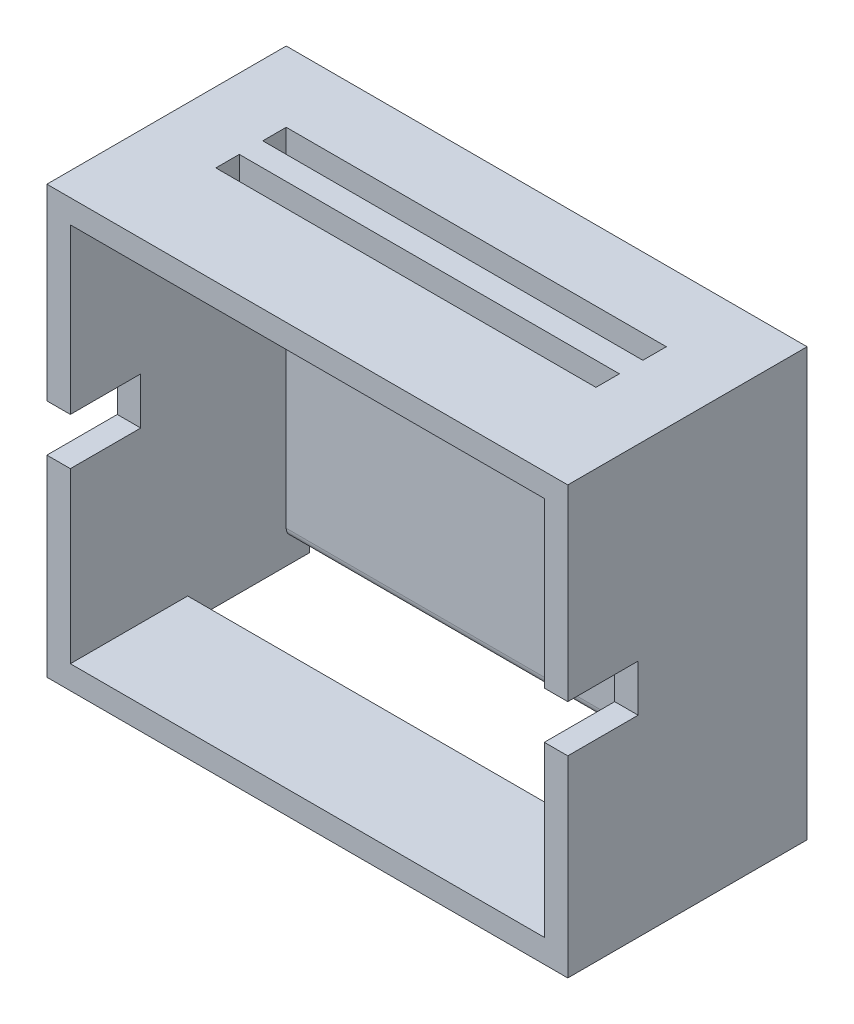
ISO-10303-21;
HEADER;
FILE_DESCRIPTION(('STEP AP214'),'2;1');
FILE_NAME('part.step','',(''),(''),'','','');
FILE_SCHEMA(('AUTOMOTIVE_DESIGN { 1 0 10303 214 1 1 1 1 }'));
ENDSEC;
DATA;
#1=APPLICATION_CONTEXT('core data for automotive mechanical design processes');
#2=APPLICATION_PROTOCOL_DEFINITION('international standard','automotive_design',2000,#1);
#3=PRODUCT_CONTEXT('',#1,'mechanical');
#4=PRODUCT('Part','Part','',(#3));
#5=PRODUCT_RELATED_PRODUCT_CATEGORY('part','',(#4));
#6=PRODUCT_DEFINITION_FORMATION('','',#4);
#7=PRODUCT_DEFINITION_CONTEXT('part definition',#1,'design');
#8=PRODUCT_DEFINITION('design','',#6,#7);
#9=PRODUCT_DEFINITION_SHAPE('','',#8);
#10=(LENGTH_UNIT() NAMED_UNIT(*) SI_UNIT(.MILLI.,.METRE.));
#11=(NAMED_UNIT(*) PLANE_ANGLE_UNIT() SI_UNIT($,.RADIAN.));
#12=(NAMED_UNIT(*) SI_UNIT($,.STERADIAN.) SOLID_ANGLE_UNIT());
#13=UNCERTAINTY_MEASURE_WITH_UNIT(LENGTH_MEASURE(1.E-05),#10,'distance_accuracy_value','');
#14=(GEOMETRIC_REPRESENTATION_CONTEXT(3) GLOBAL_UNCERTAINTY_ASSIGNED_CONTEXT((#13)) GLOBAL_UNIT_ASSIGNED_CONTEXT((#10,
#11,#12)) REPRESENTATION_CONTEXT('',''));
#15=CARTESIAN_POINT('',(0.,0.,0.));
#16=DIRECTION('',(0.,0.,1.));
#17=DIRECTION('',(1.,0.,0.));
#18=AXIS2_PLACEMENT_3D('',#15,#16,#17);
#19=CARTESIAN_POINT('',(0.,0.,46.));
#20=DIRECTION('',(0.,0.,1.));
#21=DIRECTION('',(1.,0.,0.));
#22=AXIS2_PLACEMENT_3D('',#19,#20,#21);
#23=PLANE('',#22);
#24=DIRECTION('',(-1.,0.,0.));
#25=VECTOR('',#24,1.);
#26=CARTESIAN_POINT('',(-37.1088887201052,11.7555404321783,46.));
#27=LINE('',#26,#25);
#28=CARTESIAN_POINT('',(-32.1088887201052,11.7555404321783,46.));
#29=VERTEX_POINT('',#28);
#30=CARTESIAN_POINT('',(-37.1088887201052,11.7555404321783,46.));
#31=VERTEX_POINT('',#30);
#32=EDGE_CURVE('E329',#29,#31,#27,.T.);
#33=ORIENTED_EDGE('',*,*,#32,.F.);
#34=DIRECTION('',(0.,-1.,0.));
#35=VECTOR('',#34,1.);
#36=CARTESIAN_POINT('',(-32.1088887201052,46.7555404321783,46.));
#37=LINE('',#36,#35);
#38=CARTESIAN_POINT('',(-32.1088887201052,46.7555404321783,46.));
#39=VERTEX_POINT('',#38);
#40=EDGE_CURVE('E448',#39,#29,#37,.T.);
#41=ORIENTED_EDGE('',*,*,#40,.F.);
#42=DIRECTION('',(-1.,0.,0.));
#43=VECTOR('',#42,1.);
#44=CARTESIAN_POINT('',(-32.1088887201052,46.7555404321783,46.));
#45=LINE('',#44,#43);
#46=CARTESIAN_POINT('',(68.8911112798948,46.7555404321783,46.));
#47=VERTEX_POINT('',#46);
#48=EDGE_CURVE('E461',#47,#39,#45,.T.);
#49=ORIENTED_EDGE('',*,*,#48,.F.);
#50=DIRECTION('',(0.,1.,0.));
#51=VECTOR('',#50,1.);
#52=CARTESIAN_POINT('',(68.8911112798948,46.7555404321783,46.));
#53=LINE('',#52,#51);
#54=CARTESIAN_POINT('',(68.8911112798948,11.7555404321783,46.));
#55=VERTEX_POINT('',#54);
#56=EDGE_CURVE('E456',#55,#47,#53,.T.);
#57=ORIENTED_EDGE('',*,*,#56,.F.);
#58=DIRECTION('',(-1.,0.,0.));
#59=VECTOR('',#58,1.);
#60=CARTESIAN_POINT('',(68.8911112798948,11.7555404321783,46.));
#61=LINE('',#60,#59);
#62=CARTESIAN_POINT('',(73.8911112798948,11.7555404321783,46.));
#63=VERTEX_POINT('',#62);
#64=EDGE_CURVE('E365',#63,#55,#61,.T.);
#65=ORIENTED_EDGE('',*,*,#64,.F.);
#66=DIRECTION('',(0.,1.,0.));
#67=VECTOR('',#66,1.);
#68=CARTESIAN_POINT('',(73.8911112798948,51.7555404321783,46.));
#69=LINE('',#68,#67);
#70=CARTESIAN_POINT('',(73.8911112798948,51.7555404321783,46.));
#71=VERTEX_POINT('',#70);
#72=EDGE_CURVE('E497',#63,#71,#69,.T.);
#73=ORIENTED_EDGE('',*,*,#72,.T.);
#74=DIRECTION('',(-1.,0.,0.));
#75=VECTOR('',#74,1.);
#76=CARTESIAN_POINT('',(-37.1088887201052,51.7555404321783,46.));
#77=LINE('',#76,#75);
#78=CARTESIAN_POINT('',(-37.1088887201052,51.7555404321783,46.));
#79=VERTEX_POINT('',#78);
#80=EDGE_CURVE('E502',#71,#79,#77,.T.);
#81=ORIENTED_EDGE('',*,*,#80,.T.);
#82=DIRECTION('',(0.,-1.,0.));
#83=VECTOR('',#82,1.);
#84=CARTESIAN_POINT('',(-37.1088887201052,51.7555404321783,46.));
#85=LINE('',#84,#83);
#86=EDGE_CURVE('E490',#79,#31,#85,.T.);
#87=ORIENTED_EDGE('',*,*,#86,.T.);
#88=EDGE_LOOP('',(#33,#41,#49,#57,#65,#73,#81,#87));
#89=FACE_BOUND('',#88,.T.);
#90=ADVANCED_FACE('F39',(#89),#23,.T.);
#91=DIRECTION('',(1.,0.,0.));
#92=VECTOR('',#91,1.);
#93=CARTESIAN_POINT('',(-37.1088887201052,1.75554043217829,46.));
#94=LINE('',#93,#92);
#95=CARTESIAN_POINT('',(-37.1088887201052,1.75554043217829,46.));
#96=VERTEX_POINT('',#95);
#97=CARTESIAN_POINT('',(-32.1088887201052,1.75554043217829,46.));
#98=VERTEX_POINT('',#97);
#99=EDGE_CURVE('E340',#96,#98,#94,.T.);
#100=ORIENTED_EDGE('',*,*,#99,.F.);
#101=CARTESIAN_POINT('',(-37.1088887201052,-39.2444595678217,46.));
#102=VERTEX_POINT('',#101);
#103=EDGE_CURVE('E489',#96,#102,#85,.T.);
#104=ORIENTED_EDGE('',*,*,#103,.T.);
#105=DIRECTION('',(1.,0.,0.));
#106=VECTOR('',#105,1.);
#107=CARTESIAN_POINT('',(-37.1088887201052,-39.2444595678217,46.));
#108=LINE('',#107,#106);
#109=CARTESIAN_POINT('',(73.8911112798948,-39.2444595678217,46.));
#110=VERTEX_POINT('',#109);
#111=EDGE_CURVE('E494',#102,#110,#108,.T.);
#112=ORIENTED_EDGE('',*,*,#111,.T.);
#113=CARTESIAN_POINT('',(73.8911112798948,1.75554043217829,46.));
#114=VERTEX_POINT('',#113);
#115=EDGE_CURVE('E498',#110,#114,#69,.T.);
#116=ORIENTED_EDGE('',*,*,#115,.T.);
#117=DIRECTION('',(1.,0.,0.));
#118=VECTOR('',#117,1.);
#119=CARTESIAN_POINT('',(68.8911112798948,1.75554043217829,46.));
#120=LINE('',#119,#118);
#121=CARTESIAN_POINT('',(68.8911112798948,1.75554043217829,46.));
#122=VERTEX_POINT('',#121);
#123=EDGE_CURVE('E277',#122,#114,#120,.T.);
#124=ORIENTED_EDGE('',*,*,#123,.F.);
#125=CARTESIAN_POINT('',(68.8911112798948,-34.2444595678217,46.));
#126=VERTEX_POINT('',#125);
#127=EDGE_CURVE('E457',#126,#122,#53,.T.);
#128=ORIENTED_EDGE('',*,*,#127,.F.);
#129=DIRECTION('',(1.,0.,0.));
#130=VECTOR('',#129,1.);
#131=CARTESIAN_POINT('',(-32.1088887201052,-34.2444595678217,46.));
#132=LINE('',#131,#130);
#133=CARTESIAN_POINT('',(-32.1088887201052,-34.2444595678217,46.));
#134=VERTEX_POINT('',#133);
#135=EDGE_CURVE('E452',#134,#126,#132,.T.);
#136=ORIENTED_EDGE('',*,*,#135,.F.);
#137=EDGE_CURVE('E453',#98,#134,#37,.T.);
#138=ORIENTED_EDGE('',*,*,#137,.F.);
#139=EDGE_LOOP('',(#100,#104,#112,#116,#124,#128,#136,#138));
#140=FACE_BOUND('',#139,.T.);
#141=ADVANCED_FACE('F572',(#140),#23,.T.);
#142=CARTESIAN_POINT('',(-37.1088887201052,51.7555404321783,46.));
#143=DIRECTION('',(1.,0.,0.));
#144=DIRECTION('',(0.,1.,0.));
#145=AXIS2_PLACEMENT_3D('',#142,#143,#144);
#146=PLANE('',#145);
#147=DIRECTION('',(0.,-1.,0.));
#148=VECTOR('',#147,1.);
#149=CARTESIAN_POINT('',(-37.1088887201052,11.7555404321783,31.));
#150=LINE('',#149,#148);
#151=CARTESIAN_POINT('',(-37.1088887201052,11.7555404321783,31.));
#152=VERTEX_POINT('',#151);
#153=CARTESIAN_POINT('',(-37.1088887201052,1.75554043217829,31.));
#154=VERTEX_POINT('',#153);
#155=EDGE_CURVE('E324',#152,#154,#150,.T.);
#156=ORIENTED_EDGE('',*,*,#155,.F.);
#157=DIRECTION('',(0.,0.,1.));
#158=VECTOR('',#157,1.);
#159=CARTESIAN_POINT('',(-37.1088887201052,11.7555404321783,31.));
#160=LINE('',#159,#158);
#161=EDGE_CURVE('E346',#152,#31,#160,.T.);
#162=ORIENTED_EDGE('',*,*,#161,.T.);
#163=ORIENTED_EDGE('',*,*,#86,.F.);
#164=DIRECTION('',(0.,0.,-1.));
#165=VECTOR('',#164,1.);
#166=CARTESIAN_POINT('',(-37.1088887201052,51.7555404321783,46.));
#167=LINE('',#166,#165);
#168=CARTESIAN_POINT('',(-37.1088887201052,51.7555404321783,-5.));
#169=VERTEX_POINT('',#168);
#170=EDGE_CURVE('E505',#79,#169,#167,.T.);
#171=ORIENTED_EDGE('',*,*,#170,.T.);
#172=DIRECTION('',(0.,1.,0.));
#173=VECTOR('',#172,1.);
#174=CARTESIAN_POINT('',(-37.1088887201052,-39.2444595678217,-5.));
#175=LINE('',#174,#173);
#176=CARTESIAN_POINT('',(-37.1088887201052,-39.2444595678217,-5.));
#177=VERTEX_POINT('',#176);
#178=EDGE_CURVE('E421',#177,#169,#175,.T.);
#179=ORIENTED_EDGE('',*,*,#178,.F.);
#180=DIRECTION('',(0.,0.,-1.));
#181=VECTOR('',#180,1.);
#182=CARTESIAN_POINT('',(-37.1088887201052,-39.2444595678217,46.));
#183=LINE('',#182,#181);
#184=EDGE_CURVE('E514',#102,#177,#183,.T.);
#185=ORIENTED_EDGE('',*,*,#184,.F.);
#186=ORIENTED_EDGE('',*,*,#103,.F.);
#187=DIRECTION('',(0.,0.,1.));
#188=VECTOR('',#187,1.);
#189=CARTESIAN_POINT('',(-37.1088887201052,1.75554043217829,31.));
#190=LINE('',#189,#188);
#191=EDGE_CURVE('E339',#154,#96,#190,.T.);
#192=ORIENTED_EDGE('',*,*,#191,.F.);
#193=EDGE_LOOP('',(#156,#162,#163,#171,#179,#185,#186,#192));
#194=FACE_BOUND('',#193,.T.);
#195=ADVANCED_FACE('F559',(#194),#146,.F.);
#196=CARTESIAN_POINT('',(-37.1088887201052,-39.2444595678217,46.));
#197=DIRECTION('',(0.,1.,0.));
#198=DIRECTION('',(0.,0.,1.));
#199=AXIS2_PLACEMENT_3D('',#196,#197,#198);
#200=PLANE('',#199);
#201=DIRECTION('',(-1.,0.,0.));
#202=VECTOR('',#201,1.);
#203=CARTESIAN_POINT('',(-37.1088887201052,-39.2444595678217,-5.));
#204=LINE('',#203,#202);
#205=CARTESIAN_POINT('',(-32.1088887201052,-39.2444595678217,-5.));
#206=VERTEX_POINT('',#205);
#207=EDGE_CURVE('E442',#206,#177,#204,.T.);
#208=ORIENTED_EDGE('',*,*,#207,.F.);
#209=DIRECTION('',(0.,0.,-1.));
#210=VECTOR('',#209,1.);
#211=CARTESIAN_POINT('',(-32.1088887201052,-39.2444595678217,21.));
#212=LINE('',#211,#210);
#213=CARTESIAN_POINT('',(-32.1088887201052,-39.2444595678217,21.));
#214=VERTEX_POINT('',#213);
#215=EDGE_CURVE('E350',#214,#206,#212,.T.);
#216=ORIENTED_EDGE('',*,*,#215,.F.);
#217=DIRECTION('',(-1.,0.,0.));
#218=VECTOR('',#217,1.);
#219=CARTESIAN_POINT('',(-32.1088887201052,-39.2444595678217,21.));
#220=LINE('',#219,#218);
#221=CARTESIAN_POINT('',(68.8911112798948,-39.2444595678217,21.));
#222=VERTEX_POINT('',#221);
#223=EDGE_CURVE('E396',#222,#214,#220,.T.);
#224=ORIENTED_EDGE('',*,*,#223,.F.);
#225=DIRECTION('',(0.,0.,1.));
#226=VECTOR('',#225,1.);
#227=CARTESIAN_POINT('',(68.8911112798948,-39.2444595678217,21.));
#228=LINE('',#227,#226);
#229=CARTESIAN_POINT('',(68.8911112798948,-39.2444595678217,-5.));
#230=VERTEX_POINT('',#229);
#231=EDGE_CURVE('E411',#230,#222,#228,.T.);
#232=ORIENTED_EDGE('',*,*,#231,.F.);
#233=CARTESIAN_POINT('',(73.8911112798948,-39.2444595678217,-5.));
#234=VERTEX_POINT('',#233);
#235=EDGE_CURVE('E443',#234,#230,#204,.T.);
#236=ORIENTED_EDGE('',*,*,#235,.F.);
#237=DIRECTION('',(0.,0.,-1.));
#238=VECTOR('',#237,1.);
#239=CARTESIAN_POINT('',(73.8911112798948,-39.2444595678217,46.));
#240=LINE('',#239,#238);
#241=EDGE_CURVE('E511',#110,#234,#240,.T.);
#242=ORIENTED_EDGE('',*,*,#241,.F.);
#243=ORIENTED_EDGE('',*,*,#111,.F.);
#244=ORIENTED_EDGE('',*,*,#184,.T.);
#245=EDGE_LOOP('',(#208,#216,#224,#232,#236,#242,#243,#244));
#246=FACE_BOUND('',#245,.T.);
#247=ADVANCED_FACE('F584',(#246),#200,.F.);
#248=CARTESIAN_POINT('',(73.8911112798948,51.7555404321783,46.));
#249=DIRECTION('',(-1.,0.,0.));
#250=DIRECTION('',(0.,0.,1.));
#251=AXIS2_PLACEMENT_3D('',#248,#249,#250);
#252=PLANE('',#251);
#253=ORIENTED_EDGE('',*,*,#72,.F.);
#254=DIRECTION('',(0.,0.,1.));
#255=VECTOR('',#254,1.);
#256=CARTESIAN_POINT('',(73.8911112798948,11.7555404321783,31.));
#257=LINE('',#256,#255);
#258=CARTESIAN_POINT('',(73.8911112798948,11.7555404321783,31.));
#259=VERTEX_POINT('',#258);
#260=EDGE_CURVE('E383',#259,#63,#257,.T.);
#261=ORIENTED_EDGE('',*,*,#260,.F.);
#262=DIRECTION('',(0.,1.,0.));
#263=VECTOR('',#262,1.);
#264=CARTESIAN_POINT('',(73.8911112798948,11.7555404321783,31.));
#265=LINE('',#264,#263);
#266=CARTESIAN_POINT('',(73.8911112798948,1.75554043217829,31.));
#267=VERTEX_POINT('',#266);
#268=EDGE_CURVE('E369',#267,#259,#265,.T.);
#269=ORIENTED_EDGE('',*,*,#268,.F.);
#270=DIRECTION('',(0.,0.,1.));
#271=VECTOR('',#270,1.);
#272=CARTESIAN_POINT('',(73.8911112798948,1.75554043217829,31.));
#273=LINE('',#272,#271);
#274=EDGE_CURVE('E386',#267,#114,#273,.T.);
#275=ORIENTED_EDGE('',*,*,#274,.T.);
#276=ORIENTED_EDGE('',*,*,#115,.F.);
#277=ORIENTED_EDGE('',*,*,#241,.T.);
#278=DIRECTION('',(0.,-1.,0.));
#279=VECTOR('',#278,1.);
#280=CARTESIAN_POINT('',(73.8911112798948,-39.2444595678217,-5.));
#281=LINE('',#280,#279);
#282=CARTESIAN_POINT('',(73.8911112798948,51.7555404321783,-5.));
#283=VERTEX_POINT('',#282);
#284=EDGE_CURVE('E438',#283,#234,#281,.T.);
#285=ORIENTED_EDGE('',*,*,#284,.F.);
#286=DIRECTION('',(0.,0.,-1.));
#287=VECTOR('',#286,1.);
#288=CARTESIAN_POINT('',(73.8911112798948,51.7555404321783,46.));
#289=LINE('',#288,#287);
#290=EDGE_CURVE('E508',#71,#283,#289,.T.);
#291=ORIENTED_EDGE('',*,*,#290,.F.);
#292=EDGE_LOOP('',(#253,#261,#269,#275,#276,#277,#285,#291));
#293=FACE_BOUND('',#292,.T.);
#294=ADVANCED_FACE('F596',(#293),#252,.F.);
#295=CARTESIAN_POINT('',(-37.1088887201052,51.7555404321783,46.));
#296=DIRECTION('',(0.,-1.,0.));
#297=DIRECTION('',(0.,0.,-1.));
#298=AXIS2_PLACEMENT_3D('',#295,#296,#297);
#299=PLANE('',#298);
#300=DIRECTION('',(-1.,0.,0.));
#301=VECTOR('',#300,1.);
#302=CARTESIAN_POINT('',(58.8911112798948,51.7555404321783,20.));
#303=LINE('',#302,#301);
#304=CARTESIAN_POINT('',(58.8911112798948,51.7555404321783,20.));
#305=VERTEX_POINT('',#304);
#306=CARTESIAN_POINT('',(-22.1088887201052,51.7555404321783,20.));
#307=VERTEX_POINT('',#306);
#308=EDGE_CURVE('E267',#305,#307,#303,.T.);
#309=ORIENTED_EDGE('',*,*,#308,.F.);
#310=DIRECTION('',(0.,0.,-1.));
#311=VECTOR('',#310,1.);
#312=CARTESIAN_POINT('',(58.8911112798948,51.7555404321783,25.));
#313=LINE('',#312,#311);
#314=CARTESIAN_POINT('',(58.8911112798948,51.7555404321783,25.));
#315=VERTEX_POINT('',#314);
#316=EDGE_CURVE('E55',#315,#305,#313,.T.);
#317=ORIENTED_EDGE('',*,*,#316,.F.);
#318=DIRECTION('',(1.,0.,0.));
#319=VECTOR('',#318,1.);
#320=CARTESIAN_POINT('',(58.8911112798948,51.7555404321783,25.));
#321=LINE('',#320,#319);
#322=CARTESIAN_POINT('',(-22.1088887201052,51.7555404321783,25.));
#323=VERTEX_POINT('',#322);
#324=EDGE_CURVE('E254',#323,#315,#321,.T.);
#325=ORIENTED_EDGE('',*,*,#324,.F.);
#326=DIRECTION('',(0.,0.,1.));
#327=VECTOR('',#326,1.);
#328=CARTESIAN_POINT('',(-22.1088887201052,51.7555404321783,25.));
#329=LINE('',#328,#327);
#330=EDGE_CURVE('E258',#307,#323,#329,.T.);
#331=ORIENTED_EDGE('',*,*,#330,.F.);
#332=EDGE_LOOP('',(#309,#317,#325,#331));
#333=FACE_BOUND('',#332,.T.);
#334=DIRECTION('',(-1.,0.,0.));
#335=VECTOR('',#334,1.);
#336=CARTESIAN_POINT('',(58.8911112798948,51.7555404321783,10.));
#337=LINE('',#336,#335);
#338=CARTESIAN_POINT('',(58.8911112798948,51.7555404321783,10.));
#339=VERTEX_POINT('',#338);
#340=CARTESIAN_POINT('',(-22.1088887201052,51.7555404321783,10.));
#341=VERTEX_POINT('',#340);
#342=EDGE_CURVE('E303',#339,#341,#337,.T.);
#343=ORIENTED_EDGE('',*,*,#342,.F.);
#344=DIRECTION('',(0.,0.,-1.));
#345=VECTOR('',#344,1.);
#346=CARTESIAN_POINT('',(58.8911112798948,51.7555404321783,15.));
#347=LINE('',#346,#345);
#348=CARTESIAN_POINT('',(58.8911112798948,51.7555404321783,15.));
#349=VERTEX_POINT('',#348);
#350=EDGE_CURVE('E63',#349,#339,#347,.T.);
#351=ORIENTED_EDGE('',*,*,#350,.F.);
#352=DIRECTION('',(1.,0.,0.));
#353=VECTOR('',#352,1.);
#354=CARTESIAN_POINT('',(58.8911112798948,51.7555404321783,15.));
#355=LINE('',#354,#353);
#356=CARTESIAN_POINT('',(-22.1088887201052,51.7555404321783,15.));
#357=VERTEX_POINT('',#356);
#358=EDGE_CURVE('E288',#357,#349,#355,.T.);
#359=ORIENTED_EDGE('',*,*,#358,.F.);
#360=DIRECTION('',(0.,0.,1.));
#361=VECTOR('',#360,1.);
#362=CARTESIAN_POINT('',(-22.1088887201052,51.7555404321783,15.));
#363=LINE('',#362,#361);
#364=EDGE_CURVE('E307',#341,#357,#363,.T.);
#365=ORIENTED_EDGE('',*,*,#364,.F.);
#366=EDGE_LOOP('',(#343,#351,#359,#365));
#367=FACE_BOUND('',#366,.T.);
#368=ORIENTED_EDGE('',*,*,#290,.T.);
#369=DIRECTION('',(1.,0.,0.));
#370=VECTOR('',#369,1.);
#371=CARTESIAN_POINT('',(-37.1088887201052,51.7555404321783,-5.));
#372=LINE('',#371,#370);
#373=EDGE_CURVE('E434',#169,#283,#372,.T.);
#374=ORIENTED_EDGE('',*,*,#373,.F.);
#375=ORIENTED_EDGE('',*,*,#170,.F.);
#376=ORIENTED_EDGE('',*,*,#80,.F.);
#377=EDGE_LOOP('',(#368,#374,#375,#376));
#378=FACE_BOUND('',#377,.T.);
#379=ADVANCED_FACE('F590',(#333,#367,#378),#299,.F.);
#380=CARTESIAN_POINT('',(-32.1088887201052,46.7555404321783,46.));
#381=DIRECTION('',(1.,0.,0.));
#382=DIRECTION('',(0.,1.,0.));
#383=AXIS2_PLACEMENT_3D('',#380,#381,#382);
#384=PLANE('',#383);
#385=DIRECTION('',(0.,0.,1.));
#386=VECTOR('',#385,1.);
#387=CARTESIAN_POINT('',(-32.1088887201052,11.7555404321783,31.));
#388=LINE('',#387,#386);
#389=CARTESIAN_POINT('',(-32.1088887201052,11.7555404321783,31.));
#390=VERTEX_POINT('',#389);
#391=EDGE_CURVE('E351',#390,#29,#388,.T.);
#392=ORIENTED_EDGE('',*,*,#391,.F.);
#393=DIRECTION('',(0.,1.,0.));
#394=VECTOR('',#393,1.);
#395=CARTESIAN_POINT('',(-32.1088887201052,11.7555404321783,31.));
#396=LINE('',#395,#394);
#397=CARTESIAN_POINT('',(-32.1088887201052,1.75554043217829,31.));
#398=VERTEX_POINT('',#397);
#399=EDGE_CURVE('E332',#398,#390,#396,.T.);
#400=ORIENTED_EDGE('',*,*,#399,.F.);
#401=DIRECTION('',(0.,0.,1.));
#402=VECTOR('',#401,1.);
#403=CARTESIAN_POINT('',(-32.1088887201052,1.75554043217829,31.));
#404=LINE('',#403,#402);
#405=EDGE_CURVE('E354',#398,#98,#404,.T.);
#406=ORIENTED_EDGE('',*,*,#405,.T.);
#407=ORIENTED_EDGE('',*,*,#137,.T.);
#408=DIRECTION('',(0.,0.,-1.));
#409=VECTOR('',#408,1.);
#410=CARTESIAN_POINT('',(-32.1088887201052,-34.2444595678217,46.));
#411=LINE('',#410,#409);
#412=CARTESIAN_POINT('',(-32.1088887201052,-34.2444595678217,21.));
#413=VERTEX_POINT('',#412);
#414=EDGE_CURVE('E485',#134,#413,#411,.T.);
#415=ORIENTED_EDGE('',*,*,#414,.T.);
#416=DIRECTION('',(0.,-1.,0.));
#417=VECTOR('',#416,1.);
#418=CARTESIAN_POINT('',(-32.1088887201052,-34.2444595678217,21.));
#419=LINE('',#418,#417);
#420=EDGE_CURVE('E418',#413,#214,#419,.T.);
#421=ORIENTED_EDGE('',*,*,#420,.T.);
#422=ORIENTED_EDGE('',*,*,#215,.T.);
#423=DIRECTION('',(0.,-1.,0.));
#424=VECTOR('',#423,1.);
#425=CARTESIAN_POINT('',(-32.1088887201052,-34.2444595678217,-5.));
#426=LINE('',#425,#424);
#427=CARTESIAN_POINT('',(-32.1088887201052,-34.2444595678217,-5.));
#428=VERTEX_POINT('',#427);
#429=EDGE_CURVE('E408',#428,#206,#426,.T.);
#430=ORIENTED_EDGE('',*,*,#429,.F.);
#431=DIRECTION('',(0.,0.,-1.));
#432=VECTOR('',#431,1.);
#433=CARTESIAN_POINT('',(-32.1088887201052,-34.2444595678217,21.));
#434=LINE('',#433,#432);
#435=CARTESIAN_POINT('',(-32.1088887201052,-34.2444595678217,-1.99999999999999));
#436=VERTEX_POINT('',#435);
#437=EDGE_CURVE('E392',#436,#428,#434,.T.);
#438=ORIENTED_EDGE('',*,*,#437,.F.);
#439=CARTESIAN_POINT('',(-32.1088887201052,-32.2444595678217,-2.));
#440=DIRECTION('',(1.,0.,0.));
#441=DIRECTION('',(0.,1.,0.));
#442=AXIS2_PLACEMENT_3D('',#439,#440,#441);
#443=CIRCLE('',#442,2.);
#444=CARTESIAN_POINT('',(-32.1088887201052,-32.2444595678217,0.));
#445=VERTEX_POINT('',#444);
#446=EDGE_CURVE('E11',#436,#445,#443,.F.);
#447=ORIENTED_EDGE('',*,*,#446,.T.);
#448=DIRECTION('',(0.,-1.,0.));
#449=VECTOR('',#448,1.);
#450=CARTESIAN_POINT('',(-32.1088887201052,46.7555404321783,0.));
#451=LINE('',#450,#449);
#452=CARTESIAN_POINT('',(-32.1088887201052,46.7555404321783,0.));
#453=VERTEX_POINT('',#452);
#454=EDGE_CURVE('E447',#453,#445,#451,.T.);
#455=ORIENTED_EDGE('',*,*,#454,.F.);
#456=DIRECTION('',(0.,0.,-1.));
#457=VECTOR('',#456,1.);
#458=CARTESIAN_POINT('',(-32.1088887201052,46.7555404321783,46.));
#459=LINE('',#458,#457);
#460=EDGE_CURVE('E464',#39,#453,#459,.T.);
#461=ORIENTED_EDGE('',*,*,#460,.F.);
#462=ORIENTED_EDGE('',*,*,#40,.T.);
#463=EDGE_LOOP('',(#392,#400,#406,#407,#415,#421,#422,#430,#438,#447,#455,#461,#462));
#464=FACE_BOUND('',#463,.T.);
#465=ADVANCED_FACE('F540',(#464),#384,.T.);
#466=CARTESIAN_POINT('',(-32.1088887201052,-34.2444595678217,46.));
#467=DIRECTION('',(0.,1.,0.));
#468=DIRECTION('',(0.,0.,1.));
#469=AXIS2_PLACEMENT_3D('',#466,#467,#468);
#470=PLANE('',#469);
#471=DIRECTION('',(-1.,0.,0.));
#472=VECTOR('',#471,1.);
#473=CARTESIAN_POINT('',(-32.1088887201052,-34.2444595678217,21.));
#474=LINE('',#473,#472);
#475=CARTESIAN_POINT('',(68.8911112798948,-34.2444595678217,21.));
#476=VERTEX_POINT('',#475);
#477=EDGE_CURVE('E404',#476,#413,#474,.T.);
#478=ORIENTED_EDGE('',*,*,#477,.T.);
#479=ORIENTED_EDGE('',*,*,#414,.F.);
#480=ORIENTED_EDGE('',*,*,#135,.T.);
#481=DIRECTION('',(0.,0.,-1.));
#482=VECTOR('',#481,1.);
#483=CARTESIAN_POINT('',(68.8911112798948,-34.2444595678217,46.));
#484=LINE('',#483,#482);
#485=EDGE_CURVE('E481',#126,#476,#484,.T.);
#486=ORIENTED_EDGE('',*,*,#485,.T.);
#487=EDGE_LOOP('',(#478,#479,#480,#486));
#488=FACE_BOUND('',#487,.T.);
#489=ADVANCED_FACE('F605',(#488),#470,.T.);
#490=CARTESIAN_POINT('',(68.8911112798948,46.7555404321783,46.));
#491=DIRECTION('',(-1.,0.,0.));
#492=DIRECTION('',(0.,-1.,0.));
#493=AXIS2_PLACEMENT_3D('',#490,#491,#492);
#494=PLANE('',#493);
#495=DIRECTION('',(0.,0.,1.));
#496=VECTOR('',#495,1.);
#497=CARTESIAN_POINT('',(68.8911112798948,11.7555404321783,31.));
#498=LINE('',#497,#496);
#499=CARTESIAN_POINT('',(68.8911112798948,11.7555404321783,31.));
#500=VERTEX_POINT('',#499);
#501=EDGE_CURVE('E343',#500,#55,#498,.T.);
#502=ORIENTED_EDGE('',*,*,#501,.T.);
#503=ORIENTED_EDGE('',*,*,#56,.T.);
#504=DIRECTION('',(0.,0.,-1.));
#505=VECTOR('',#504,1.);
#506=CARTESIAN_POINT('',(68.8911112798948,46.7555404321783,46.));
#507=LINE('',#506,#505);
#508=CARTESIAN_POINT('',(68.8911112798948,46.7555404321783,0.));
#509=VERTEX_POINT('',#508);
#510=EDGE_CURVE('E477',#47,#509,#507,.T.);
#511=ORIENTED_EDGE('',*,*,#510,.T.);
#512=DIRECTION('',(0.,1.,0.));
#513=VECTOR('',#512,1.);
#514=CARTESIAN_POINT('',(68.8911112798948,46.7555404321783,0.));
#515=LINE('',#514,#513);
#516=CARTESIAN_POINT('',(68.8911112798948,-32.2444595678217,0.));
#517=VERTEX_POINT('',#516);
#518=EDGE_CURVE('E468',#517,#509,#515,.T.);
#519=ORIENTED_EDGE('',*,*,#518,.F.);
#520=CARTESIAN_POINT('',(68.8911112798948,-32.2444595678217,-2.));
#521=DIRECTION('',(-1.,0.,0.));
#522=DIRECTION('',(0.,-1.,0.));
#523=AXIS2_PLACEMENT_3D('',#520,#521,#522);
#524=CIRCLE('',#523,2.);
#525=CARTESIAN_POINT('',(68.8911112798948,-34.2444595678217,-1.99999999999999));
#526=VERTEX_POINT('',#525);
#527=EDGE_CURVE('E48',#517,#526,#524,.F.);
#528=ORIENTED_EDGE('',*,*,#527,.T.);
#529=DIRECTION('',(0.,0.,1.));
#530=VECTOR('',#529,1.);
#531=CARTESIAN_POINT('',(68.8911112798948,-34.2444595678217,21.));
#532=LINE('',#531,#530);
#533=CARTESIAN_POINT('',(68.8911112798948,-34.2444595678217,-5.));
#534=VERTEX_POINT('',#533);
#535=EDGE_CURVE('E400',#534,#526,#532,.T.);
#536=ORIENTED_EDGE('',*,*,#535,.F.);
#537=DIRECTION('',(0.,-1.,0.));
#538=VECTOR('',#537,1.);
#539=CARTESIAN_POINT('',(68.8911112798948,-34.2444595678217,-5.));
#540=LINE('',#539,#538);
#541=EDGE_CURVE('E425',#534,#230,#540,.T.);
#542=ORIENTED_EDGE('',*,*,#541,.T.);
#543=ORIENTED_EDGE('',*,*,#231,.T.);
#544=DIRECTION('',(0.,-1.,0.));
#545=VECTOR('',#544,1.);
#546=CARTESIAN_POINT('',(68.8911112798948,-34.2444595678217,21.));
#547=LINE('',#546,#545);
#548=EDGE_CURVE('E422',#476,#222,#547,.T.);
#549=ORIENTED_EDGE('',*,*,#548,.F.);
#550=ORIENTED_EDGE('',*,*,#485,.F.);
#551=ORIENTED_EDGE('',*,*,#127,.T.);
#552=DIRECTION('',(0.,0.,1.));
#553=VECTOR('',#552,1.);
#554=CARTESIAN_POINT('',(68.8911112798948,1.75554043217829,31.));
#555=LINE('',#554,#553);
#556=CARTESIAN_POINT('',(68.8911112798948,1.75554043217829,31.));
#557=VERTEX_POINT('',#556);
#558=EDGE_CURVE('E375',#557,#122,#555,.T.);
#559=ORIENTED_EDGE('',*,*,#558,.F.);
#560=DIRECTION('',(0.,-1.,0.));
#561=VECTOR('',#560,1.);
#562=CARTESIAN_POINT('',(68.8911112798948,11.7555404321783,31.));
#563=LINE('',#562,#561);
#564=EDGE_CURVE('E360',#500,#557,#563,.T.);
#565=ORIENTED_EDGE('',*,*,#564,.F.);
#566=EDGE_LOOP('',(#502,#503,#511,#519,#528,#536,#542,#543,#549,#550,#551,#559,#565));
#567=FACE_BOUND('',#566,.T.);
#568=ADVANCED_FACE('F527',(#567),#494,.T.);
#569=CARTESIAN_POINT('',(-32.1088887201052,46.7555404321783,46.));
#570=DIRECTION('',(0.,-1.,0.));
#571=DIRECTION('',(0.,0.,-1.));
#572=AXIS2_PLACEMENT_3D('',#569,#570,#571);
#573=PLANE('',#572);
#574=DIRECTION('',(0.,0.,-1.));
#575=VECTOR('',#574,1.);
#576=CARTESIAN_POINT('',(58.8911112798948,46.7555404321783,25.));
#577=LINE('',#576,#575);
#578=CARTESIAN_POINT('',(58.8911112798948,46.7555404321783,25.));
#579=VERTEX_POINT('',#578);
#580=CARTESIAN_POINT('',(58.8911112798948,46.7555404321783,20.));
#581=VERTEX_POINT('',#580);
#582=EDGE_CURVE('E232',#579,#581,#577,.T.);
#583=ORIENTED_EDGE('',*,*,#582,.T.);
#584=DIRECTION('',(-1.,0.,0.));
#585=VECTOR('',#584,1.);
#586=CARTESIAN_POINT('',(58.8911112798948,46.7555404321783,20.));
#587=LINE('',#586,#585);
#588=CARTESIAN_POINT('',(-22.1088887201052,46.7555404321783,20.));
#589=VERTEX_POINT('',#588);
#590=EDGE_CURVE('E243',#581,#589,#587,.T.);
#591=ORIENTED_EDGE('',*,*,#590,.T.);
#592=DIRECTION('',(0.,0.,1.));
#593=VECTOR('',#592,1.);
#594=CARTESIAN_POINT('',(-22.1088887201052,46.7555404321783,25.));
#595=LINE('',#594,#593);
#596=CARTESIAN_POINT('',(-22.1088887201052,46.7555404321783,25.));
#597=VERTEX_POINT('',#596);
#598=EDGE_CURVE('E248',#589,#597,#595,.T.);
#599=ORIENTED_EDGE('',*,*,#598,.T.);
#600=DIRECTION('',(1.,0.,0.));
#601=VECTOR('',#600,1.);
#602=CARTESIAN_POINT('',(58.8911112798948,46.7555404321783,25.));
#603=LINE('',#602,#601);
#604=EDGE_CURVE('E239',#597,#579,#603,.T.);
#605=ORIENTED_EDGE('',*,*,#604,.T.);
#606=EDGE_LOOP('',(#583,#591,#599,#605));
#607=FACE_BOUND('',#606,.T.);
#608=DIRECTION('',(0.,0.,-1.));
#609=VECTOR('',#608,1.);
#610=CARTESIAN_POINT('',(58.8911112798948,46.7555404321783,15.));
#611=LINE('',#610,#609);
#612=CARTESIAN_POINT('',(58.8911112798948,46.7555404321783,15.));
#613=VERTEX_POINT('',#612);
#614=CARTESIAN_POINT('',(58.8911112798948,46.7555404321783,10.));
#615=VERTEX_POINT('',#614);
#616=EDGE_CURVE('E283',#613,#615,#611,.T.);
#617=ORIENTED_EDGE('',*,*,#616,.T.);
#618=DIRECTION('',(-1.,0.,0.));
#619=VECTOR('',#618,1.);
#620=CARTESIAN_POINT('',(58.8911112798948,46.7555404321783,10.));
#621=LINE('',#620,#619);
#622=CARTESIAN_POINT('',(-22.1088887201052,46.7555404321783,10.));
#623=VERTEX_POINT('',#622);
#624=EDGE_CURVE('E287',#615,#623,#621,.T.);
#625=ORIENTED_EDGE('',*,*,#624,.T.);
#626=DIRECTION('',(0.,0.,1.));
#627=VECTOR('',#626,1.);
#628=CARTESIAN_POINT('',(-22.1088887201052,46.7555404321783,15.));
#629=LINE('',#628,#627);
#630=CARTESIAN_POINT('',(-22.1088887201052,46.7555404321783,15.));
#631=VERTEX_POINT('',#630);
#632=EDGE_CURVE('E292',#623,#631,#629,.T.);
#633=ORIENTED_EDGE('',*,*,#632,.T.);
#634=DIRECTION('',(1.,0.,0.));
#635=VECTOR('',#634,1.);
#636=CARTESIAN_POINT('',(58.8911112798948,46.7555404321783,15.));
#637=LINE('',#636,#635);
#638=EDGE_CURVE('E296',#631,#613,#637,.T.);
#639=ORIENTED_EDGE('',*,*,#638,.T.);
#640=EDGE_LOOP('',(#617,#625,#633,#639));
#641=FACE_BOUND('',#640,.T.);
#642=DIRECTION('',(-1.,0.,0.));
#643=VECTOR('',#642,1.);
#644=CARTESIAN_POINT('',(-32.1088887201052,46.7555404321783,0.));
#645=LINE('',#644,#643);
#646=EDGE_CURVE('E471',#509,#453,#645,.T.);
#647=ORIENTED_EDGE('',*,*,#646,.F.);
#648=ORIENTED_EDGE('',*,*,#510,.F.);
#649=ORIENTED_EDGE('',*,*,#48,.T.);
#650=ORIENTED_EDGE('',*,*,#460,.T.);
#651=EDGE_LOOP('',(#647,#648,#649,#650));
#652=FACE_BOUND('',#651,.T.);
#653=ADVANCED_FACE('F250',(#607,#641,#652),#573,.T.);
#654=CARTESIAN_POINT('',(0.,0.,0.));
#655=DIRECTION('',(0.,0.,-1.));
#656=DIRECTION('',(-1.,0.,0.));
#657=AXIS2_PLACEMENT_3D('',#654,#655,#656);
#658=PLANE('',#657);
#659=ORIENTED_EDGE('',*,*,#454,.T.);
#660=DIRECTION('',(1.,0.,0.));
#661=VECTOR('',#660,1.);
#662=CARTESIAN_POINT('',(68.8911112798948,-32.2444595678217,0.));
#663=LINE('',#662,#661);
#664=EDGE_CURVE('E518',#445,#517,#663,.T.);
#665=ORIENTED_EDGE('',*,*,#664,.T.);
#666=ORIENTED_EDGE('',*,*,#518,.T.);
#667=ORIENTED_EDGE('',*,*,#646,.T.);
#668=EDGE_LOOP('',(#659,#665,#666,#667));
#669=FACE_BOUND('',#668,.T.);
#670=ADVANCED_FACE('F544',(#669),#658,.F.);
#671=CARTESIAN_POINT('',(0.,0.,-5.));
#672=DIRECTION('',(0.,0.,-1.));
#673=DIRECTION('',(-1.,0.,0.));
#674=AXIS2_PLACEMENT_3D('',#671,#672,#673);
#675=PLANE('',#674);
#676=ORIENTED_EDGE('',*,*,#429,.T.);
#677=ORIENTED_EDGE('',*,*,#207,.T.);
#678=ORIENTED_EDGE('',*,*,#178,.T.);
#679=ORIENTED_EDGE('',*,*,#373,.T.);
#680=ORIENTED_EDGE('',*,*,#284,.T.);
#681=ORIENTED_EDGE('',*,*,#235,.T.);
#682=ORIENTED_EDGE('',*,*,#541,.F.);
#683=DIRECTION('',(1.,0.,0.));
#684=VECTOR('',#683,1.);
#685=CARTESIAN_POINT('',(-32.1088887201052,-34.2444595678217,-5.));
#686=LINE('',#685,#684);
#687=EDGE_CURVE('E395',#428,#534,#686,.T.);
#688=ORIENTED_EDGE('',*,*,#687,.F.);
#689=EDGE_LOOP('',(#676,#677,#678,#679,#680,#681,#682,#688));
#690=FACE_BOUND('',#689,.T.);
#691=ADVANCED_FACE('F578',(#690),#675,.T.);
#692=CARTESIAN_POINT('',(0.,-34.2444595678217,0.));
#693=DIRECTION('',(0.,-1.,0.));
#694=DIRECTION('',(0.,0.,-1.));
#695=AXIS2_PLACEMENT_3D('',#692,#693,#694);
#696=PLANE('',#695);
#697=ORIENTED_EDGE('',*,*,#535,.T.);
#698=DIRECTION('',(1.,0.,0.));
#699=VECTOR('',#698,1.);
#700=CARTESIAN_POINT('',(-32.1088887201052,-34.2444595678217,-2.));
#701=LINE('',#700,#699);
#702=EDGE_CURVE('E522',#526,#436,#701,.F.);
#703=ORIENTED_EDGE('',*,*,#702,.T.);
#704=ORIENTED_EDGE('',*,*,#437,.T.);
#705=ORIENTED_EDGE('',*,*,#687,.T.);
#706=EDGE_LOOP('',(#697,#703,#704,#705));
#707=FACE_BOUND('',#706,.T.);
#708=ADVANCED_FACE('F532',(#707),#696,.T.);
#709=CARTESIAN_POINT('',(-32.1088887201052,-34.2444595678217,21.));
#710=DIRECTION('',(0.,0.,1.));
#711=DIRECTION('',(1.,0.,0.));
#712=AXIS2_PLACEMENT_3D('',#709,#710,#711);
#713=PLANE('',#712);
#714=ORIENTED_EDGE('',*,*,#223,.T.);
#715=ORIENTED_EDGE('',*,*,#420,.F.);
#716=ORIENTED_EDGE('',*,*,#477,.F.);
#717=ORIENTED_EDGE('',*,*,#548,.T.);
#718=EDGE_LOOP('',(#714,#715,#716,#717));
#719=FACE_BOUND('',#718,.T.);
#720=ADVANCED_FACE('F603',(#719),#713,.F.);
#721=CARTESIAN_POINT('',(0.,-32.2444595678217,-2.));
#722=DIRECTION('',(-1.,0.,0.));
#723=DIRECTION('',(0.,0.,1.));
#724=AXIS2_PLACEMENT_3D('',#721,#722,#723);
#725=CYLINDRICAL_SURFACE('',#724,2.);
#726=ORIENTED_EDGE('',*,*,#446,.F.);
#727=ORIENTED_EDGE('',*,*,#702,.F.);
#728=ORIENTED_EDGE('',*,*,#527,.F.);
#729=ORIENTED_EDGE('',*,*,#664,.F.);
#730=EDGE_LOOP('',(#726,#727,#728,#729));
#731=FACE_BOUND('',#730,.T.);
#732=ADVANCED_FACE('F41',(#731),#725,.T.);
#733=CARTESIAN_POINT('',(68.8911112798948,11.7555404321783,31.));
#734=DIRECTION('',(0.,1.,0.));
#735=DIRECTION('',(0.,0.,1.));
#736=AXIS2_PLACEMENT_3D('',#733,#734,#735);
#737=PLANE('',#736);
#738=ORIENTED_EDGE('',*,*,#64,.T.);
#739=ORIENTED_EDGE('',*,*,#501,.F.);
#740=DIRECTION('',(-1.,0.,0.));
#741=VECTOR('',#740,1.);
#742=CARTESIAN_POINT('',(68.8911112798948,11.7555404321783,31.));
#743=LINE('',#742,#741);
#744=EDGE_CURVE('E372',#259,#500,#743,.T.);
#745=ORIENTED_EDGE('',*,*,#744,.F.);
#746=ORIENTED_EDGE('',*,*,#260,.T.);
#747=EDGE_LOOP('',(#738,#739,#745,#746));
#748=FACE_BOUND('',#747,.T.);
#749=ADVANCED_FACE('F617',(#748),#737,.F.);
#750=CARTESIAN_POINT('',(68.8911112798948,1.75554043217829,31.));
#751=DIRECTION('',(0.,-1.,0.));
#752=DIRECTION('',(0.,0.,-1.));
#753=AXIS2_PLACEMENT_3D('',#750,#751,#752);
#754=PLANE('',#753);
#755=ORIENTED_EDGE('',*,*,#123,.T.);
#756=ORIENTED_EDGE('',*,*,#274,.F.);
#757=DIRECTION('',(1.,0.,0.));
#758=VECTOR('',#757,1.);
#759=CARTESIAN_POINT('',(68.8911112798948,1.75554043217829,31.));
#760=LINE('',#759,#758);
#761=EDGE_CURVE('E364',#557,#267,#760,.T.);
#762=ORIENTED_EDGE('',*,*,#761,.F.);
#763=ORIENTED_EDGE('',*,*,#558,.T.);
#764=EDGE_LOOP('',(#755,#756,#762,#763));
#765=FACE_BOUND('',#764,.T.);
#766=ADVANCED_FACE('F609',(#765),#754,.F.);
#767=CARTESIAN_POINT('',(0.,0.,31.));
#768=DIRECTION('',(0.,0.,1.));
#769=DIRECTION('',(1.,0.,0.));
#770=AXIS2_PLACEMENT_3D('',#767,#768,#769);
#771=PLANE('',#770);
#772=ORIENTED_EDGE('',*,*,#564,.T.);
#773=ORIENTED_EDGE('',*,*,#761,.T.);
#774=ORIENTED_EDGE('',*,*,#268,.T.);
#775=ORIENTED_EDGE('',*,*,#744,.T.);
#776=EDGE_LOOP('',(#772,#773,#774,#775));
#777=FACE_BOUND('',#776,.T.);
#778=ADVANCED_FACE('F614',(#777),#771,.T.);
#779=CARTESIAN_POINT('',(-37.1088887201052,11.7555404321783,31.));
#780=DIRECTION('',(0.,1.,0.));
#781=DIRECTION('',(-1.,0.,0.));
#782=AXIS2_PLACEMENT_3D('',#779,#780,#781);
#783=PLANE('',#782);
#784=ORIENTED_EDGE('',*,*,#32,.T.);
#785=ORIENTED_EDGE('',*,*,#161,.F.);
#786=DIRECTION('',(-1.,0.,0.));
#787=VECTOR('',#786,1.);
#788=CARTESIAN_POINT('',(-37.1088887201052,11.7555404321783,31.));
#789=LINE('',#788,#787);
#790=EDGE_CURVE('E335',#390,#152,#789,.T.);
#791=ORIENTED_EDGE('',*,*,#790,.F.);
#792=ORIENTED_EDGE('',*,*,#391,.T.);
#793=EDGE_LOOP('',(#784,#785,#791,#792));
#794=FACE_BOUND('',#793,.T.);
#795=ADVANCED_FACE('F555',(#794),#783,.F.);
#796=CARTESIAN_POINT('',(-37.1088887201052,1.75554043217829,31.));
#797=DIRECTION('',(0.,-1.,0.));
#798=DIRECTION('',(1.,0.,0.));
#799=AXIS2_PLACEMENT_3D('',#796,#797,#798);
#800=PLANE('',#799);
#801=ORIENTED_EDGE('',*,*,#99,.T.);
#802=ORIENTED_EDGE('',*,*,#405,.F.);
#803=DIRECTION('',(1.,0.,0.));
#804=VECTOR('',#803,1.);
#805=CARTESIAN_POINT('',(-37.1088887201052,1.75554043217829,31.));
#806=LINE('',#805,#804);
#807=EDGE_CURVE('E328',#154,#398,#806,.T.);
#808=ORIENTED_EDGE('',*,*,#807,.F.);
#809=ORIENTED_EDGE('',*,*,#191,.T.);
#810=EDGE_LOOP('',(#801,#802,#808,#809));
#811=FACE_BOUND('',#810,.T.);
#812=ADVANCED_FACE('F789',(#811),#800,.F.);
#813=CARTESIAN_POINT('',(0.,0.,31.));
#814=DIRECTION('',(0.,0.,1.));
#815=DIRECTION('',(1.,0.,0.));
#816=AXIS2_PLACEMENT_3D('',#813,#814,#815);
#817=PLANE('',#816);
#818=ORIENTED_EDGE('',*,*,#155,.T.);
#819=ORIENTED_EDGE('',*,*,#807,.T.);
#820=ORIENTED_EDGE('',*,*,#399,.T.);
#821=ORIENTED_EDGE('',*,*,#790,.T.);
#822=EDGE_LOOP('',(#818,#819,#820,#821));
#823=FACE_BOUND('',#822,.T.);
#824=ADVANCED_FACE('F563',(#823),#817,.T.);
#825=CARTESIAN_POINT('',(58.8911112798948,46.7555404321783,15.));
#826=DIRECTION('',(1.,0.,0.));
#827=DIRECTION('',(0.,0.,-1.));
#828=AXIS2_PLACEMENT_3D('',#825,#826,#827);
#829=PLANE('',#828);
#830=ORIENTED_EDGE('',*,*,#350,.T.);
#831=DIRECTION('',(0.,1.,0.));
#832=VECTOR('',#831,1.);
#833=CARTESIAN_POINT('',(58.8911112798948,46.7555404321783,10.));
#834=LINE('',#833,#832);
#835=EDGE_CURVE('E300',#615,#339,#834,.T.);
#836=ORIENTED_EDGE('',*,*,#835,.F.);
#837=ORIENTED_EDGE('',*,*,#616,.F.);
#838=DIRECTION('',(0.,1.,0.));
#839=VECTOR('',#838,1.);
#840=CARTESIAN_POINT('',(58.8911112798948,46.7555404321783,15.));
#841=LINE('',#840,#839);
#842=EDGE_CURVE('E268',#613,#349,#841,.T.);
#843=ORIENTED_EDGE('',*,*,#842,.T.);
#844=EDGE_LOOP('',(#830,#836,#837,#843));
#845=FACE_BOUND('',#844,.T.);
#846=ADVANCED_FACE('F803',(#845),#829,.F.);
#847=CARTESIAN_POINT('',(58.8911112798948,46.7555404321783,15.));
#848=DIRECTION('',(0.,0.,1.));
#849=DIRECTION('',(1.,0.,0.));
#850=AXIS2_PLACEMENT_3D('',#847,#848,#849);
#851=PLANE('',#850);
#852=ORIENTED_EDGE('',*,*,#358,.T.);
#853=ORIENTED_EDGE('',*,*,#842,.F.);
#854=ORIENTED_EDGE('',*,*,#638,.F.);
#855=DIRECTION('',(0.,1.,0.));
#856=VECTOR('',#855,1.);
#857=CARTESIAN_POINT('',(-22.1088887201052,46.7555404321783,15.));
#858=LINE('',#857,#856);
#859=EDGE_CURVE('E316',#631,#357,#858,.T.);
#860=ORIENTED_EDGE('',*,*,#859,.T.);
#861=EDGE_LOOP('',(#852,#853,#854,#860));
#862=FACE_BOUND('',#861,.T.);
#863=ADVANCED_FACE('F810',(#862),#851,.F.);
#864=CARTESIAN_POINT('',(-22.1088887201052,46.7555404321783,15.));
#865=DIRECTION('',(-1.,0.,0.));
#866=DIRECTION('',(0.,0.,1.));
#867=AXIS2_PLACEMENT_3D('',#864,#865,#866);
#868=PLANE('',#867);
#869=ORIENTED_EDGE('',*,*,#364,.T.);
#870=ORIENTED_EDGE('',*,*,#859,.F.);
#871=ORIENTED_EDGE('',*,*,#632,.F.);
#872=DIRECTION('',(0.,1.,0.));
#873=VECTOR('',#872,1.);
#874=CARTESIAN_POINT('',(-22.1088887201052,46.7555404321783,10.));
#875=LINE('',#874,#873);
#876=EDGE_CURVE('E319',#623,#341,#875,.T.);
#877=ORIENTED_EDGE('',*,*,#876,.T.);
#878=EDGE_LOOP('',(#869,#870,#871,#877));
#879=FACE_BOUND('',#878,.T.);
#880=ADVANCED_FACE('F818',(#879),#868,.F.);
#881=CARTESIAN_POINT('',(58.8911112798948,46.7555404321783,10.));
#882=DIRECTION('',(0.,0.,-1.));
#883=DIRECTION('',(-1.,0.,0.));
#884=AXIS2_PLACEMENT_3D('',#881,#882,#883);
#885=PLANE('',#884);
#886=ORIENTED_EDGE('',*,*,#342,.T.);
#887=ORIENTED_EDGE('',*,*,#876,.F.);
#888=ORIENTED_EDGE('',*,*,#624,.F.);
#889=ORIENTED_EDGE('',*,*,#835,.T.);
#890=EDGE_LOOP('',(#886,#887,#888,#889));
#891=FACE_BOUND('',#890,.T.);
#892=ADVANCED_FACE('F827',(#891),#885,.F.);
#893=CARTESIAN_POINT('',(58.8911112798948,46.7555404321783,25.));
#894=DIRECTION('',(1.,0.,0.));
#895=DIRECTION('',(0.,0.,-1.));
#896=AXIS2_PLACEMENT_3D('',#893,#894,#895);
#897=PLANE('',#896);
#898=ORIENTED_EDGE('',*,*,#316,.T.);
#899=DIRECTION('',(0.,1.,0.));
#900=VECTOR('',#899,1.);
#901=CARTESIAN_POINT('',(58.8911112798948,46.7555404321783,20.));
#902=LINE('',#901,#900);
#903=EDGE_CURVE('E228',#581,#305,#902,.T.);
#904=ORIENTED_EDGE('',*,*,#903,.F.);
#905=ORIENTED_EDGE('',*,*,#582,.F.);
#906=DIRECTION('',(0.,1.,0.));
#907=VECTOR('',#906,1.);
#908=CARTESIAN_POINT('',(58.8911112798948,46.7555404321783,25.));
#909=LINE('',#908,#907);
#910=EDGE_CURVE('E274',#579,#315,#909,.T.);
#911=ORIENTED_EDGE('',*,*,#910,.T.);
#912=EDGE_LOOP('',(#898,#904,#905,#911));
#913=FACE_BOUND('',#912,.T.);
#914=ADVANCED_FACE('F230',(#913),#897,.F.);
#915=CARTESIAN_POINT('',(58.8911112798948,46.7555404321783,25.));
#916=DIRECTION('',(0.,0.,1.));
#917=DIRECTION('',(1.,0.,0.));
#918=AXIS2_PLACEMENT_3D('',#915,#916,#917);
#919=PLANE('',#918);
#920=ORIENTED_EDGE('',*,*,#324,.T.);
#921=ORIENTED_EDGE('',*,*,#910,.F.);
#922=ORIENTED_EDGE('',*,*,#604,.F.);
#923=DIRECTION('',(0.,1.,0.));
#924=VECTOR('',#923,1.);
#925=CARTESIAN_POINT('',(-22.1088887201052,46.7555404321783,25.));
#926=LINE('',#925,#924);
#927=EDGE_CURVE('E278',#597,#323,#926,.T.);
#928=ORIENTED_EDGE('',*,*,#927,.T.);
#929=EDGE_LOOP('',(#920,#921,#922,#928));
#930=FACE_BOUND('',#929,.T.);
#931=ADVANCED_FACE('F844',(#930),#919,.F.);
#932=CARTESIAN_POINT('',(-22.1088887201052,46.7555404321783,25.));
#933=DIRECTION('',(-1.,0.,0.));
#934=DIRECTION('',(0.,0.,1.));
#935=AXIS2_PLACEMENT_3D('',#932,#933,#934);
#936=PLANE('',#935);
#937=ORIENTED_EDGE('',*,*,#330,.T.);
#938=ORIENTED_EDGE('',*,*,#927,.F.);
#939=ORIENTED_EDGE('',*,*,#598,.F.);
#940=DIRECTION('',(0.,1.,0.));
#941=VECTOR('',#940,1.);
#942=CARTESIAN_POINT('',(-22.1088887201052,46.7555404321783,20.));
#943=LINE('',#942,#941);
#944=EDGE_CURVE('E238',#589,#307,#943,.T.);
#945=ORIENTED_EDGE('',*,*,#944,.T.);
#946=EDGE_LOOP('',(#937,#938,#939,#945));
#947=FACE_BOUND('',#946,.T.);
#948=ADVANCED_FACE('F852',(#947),#936,.F.);
#949=CARTESIAN_POINT('',(58.8911112798948,46.7555404321783,20.));
#950=DIRECTION('',(0.,0.,-1.));
#951=DIRECTION('',(-1.,0.,0.));
#952=AXIS2_PLACEMENT_3D('',#949,#950,#951);
#953=PLANE('',#952);
#954=ORIENTED_EDGE('',*,*,#308,.T.);
#955=ORIENTED_EDGE('',*,*,#944,.F.);
#956=ORIENTED_EDGE('',*,*,#590,.F.);
#957=ORIENTED_EDGE('',*,*,#903,.T.);
#958=EDGE_LOOP('',(#954,#955,#956,#957));
#959=FACE_BOUND('',#958,.T.);
#960=ADVANCED_FACE('F244',(#959),#953,.F.);
#961=CLOSED_SHELL('',(#90,#141,#195,#247,#294,#379,#465,#489,#568,#653,#670,#691,#708,#720,#732,
#749,#766,#778,#795,#812,#824,#846,#863,#880,#892,#914,#931,#948,#960));
#962=MANIFOLD_SOLID_BREP('B2',#961);
#963=ADVANCED_BREP_SHAPE_REPRESENTATION('',(#18,#962),#14);
#964=SHAPE_DEFINITION_REPRESENTATION(#9,#963);
ENDSEC;
END-ISO-10303-21;
